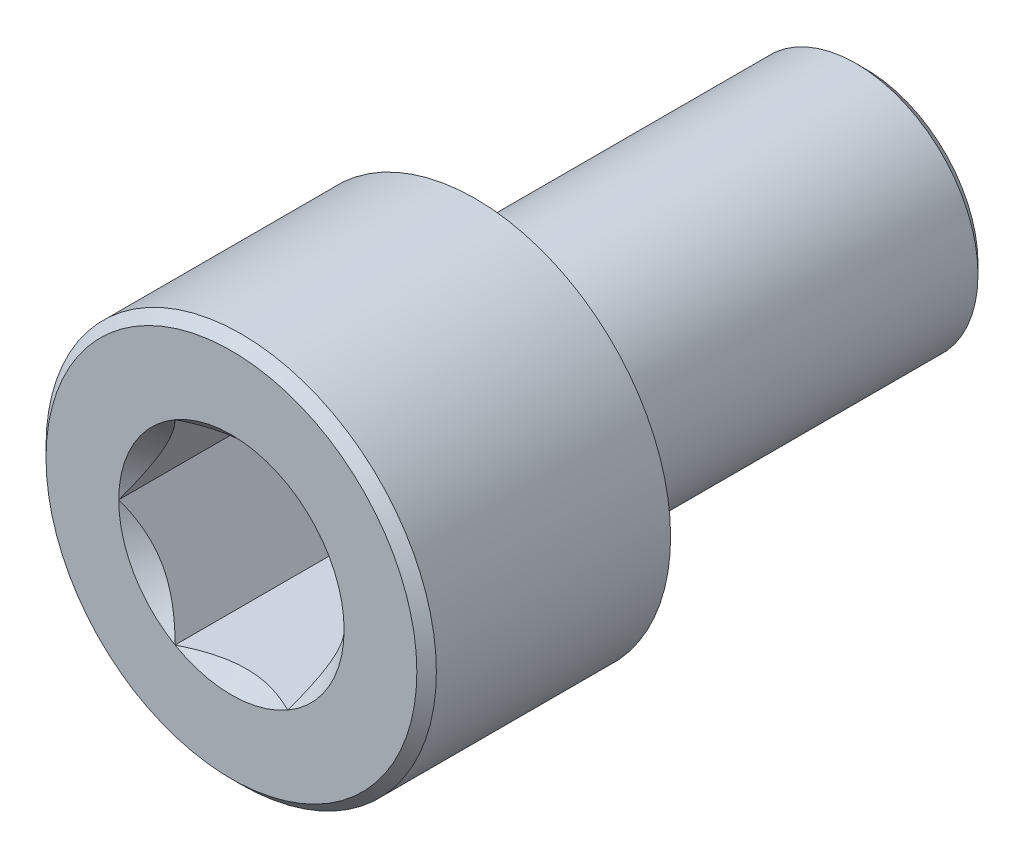
ISO-10303-21;
HEADER;
FILE_DESCRIPTION(('STEP AP214'),'2;1');
FILE_NAME('part.step','',(''),(''),'','','');
FILE_SCHEMA(('AUTOMOTIVE_DESIGN { 1 0 10303 214 1 1 1 1 }'));
ENDSEC;
DATA;
#1=APPLICATION_CONTEXT('core data for automotive mechanical design processes');
#2=APPLICATION_PROTOCOL_DEFINITION('international standard','automotive_design',2000,#1);
#3=PRODUCT_CONTEXT('',#1,'mechanical');
#4=PRODUCT('Part','Part','',(#3));
#5=PRODUCT_RELATED_PRODUCT_CATEGORY('part','',(#4));
#6=PRODUCT_DEFINITION_FORMATION('','',#4);
#7=PRODUCT_DEFINITION_CONTEXT('part definition',#1,'design');
#8=PRODUCT_DEFINITION('design','',#6,#7);
#9=PRODUCT_DEFINITION_SHAPE('','',#8);
#10=(LENGTH_UNIT() NAMED_UNIT(*) SI_UNIT(.MILLI.,.METRE.));
#11=(NAMED_UNIT(*) PLANE_ANGLE_UNIT() SI_UNIT($,.RADIAN.));
#12=(NAMED_UNIT(*) SI_UNIT($,.STERADIAN.) SOLID_ANGLE_UNIT());
#13=UNCERTAINTY_MEASURE_WITH_UNIT(LENGTH_MEASURE(1.E-05),#10,'distance_accuracy_value','');
#14=(GEOMETRIC_REPRESENTATION_CONTEXT(3) GLOBAL_UNCERTAINTY_ASSIGNED_CONTEXT((#13)) GLOBAL_UNIT_ASSIGNED_CONTEXT((#10,
#11,#12)) REPRESENTATION_CONTEXT('',''));
#15=CARTESIAN_POINT('',(0.,0.,0.));
#16=DIRECTION('',(0.,0.,1.));
#17=DIRECTION('',(1.,0.,0.));
#18=AXIS2_PLACEMENT_3D('',#15,#16,#17);
#19=CARTESIAN_POINT('',(0.,0.,0.));
#20=DIRECTION('',(0.,0.,1.));
#21=DIRECTION('',(1.,0.,0.));
#22=AXIS2_PLACEMENT_3D('',#19,#20,#21);
#23=PLANE('',#22);
#24=CARTESIAN_POINT('',(0.,0.,0.));
#25=DIRECTION('',(0.,0.,1.));
#26=DIRECTION('',(1.,0.,0.));
#27=AXIS2_PLACEMENT_3D('',#24,#25,#26);
#28=CIRCLE('',#27,4.);
#29=CARTESIAN_POINT('',(4.,0.,0.));
#30=VERTEX_POINT('',#29);
#31=EDGE_CURVE('E109',#30,#30,#28,.T.);
#32=ORIENTED_EDGE('',*,*,#31,.F.);
#33=EDGE_LOOP('',(#32));
#34=FACE_BOUND('',#33,.T.);
#35=CARTESIAN_POINT('',(0.,0.,0.));
#36=DIRECTION('',(0.,0.,1.));
#37=DIRECTION('',(1.,0.,0.));
#38=AXIS2_PLACEMENT_3D('',#35,#36,#37);
#39=CIRCLE('',#38,2.5);
#40=CARTESIAN_POINT('',(2.5,0.,0.));
#41=VERTEX_POINT('',#40);
#42=EDGE_CURVE('E173',#41,#41,#39,.F.);
#43=ORIENTED_EDGE('',*,*,#42,.F.);
#44=EDGE_LOOP('',(#43));
#45=FACE_BOUND('',#44,.T.);
#46=ADVANCED_FACE('F34',(#34,#45),#23,.F.);
#47=CARTESIAN_POINT('',(0.,0.,5.));
#48=DIRECTION('',(0.,0.,-1.));
#49=DIRECTION('',(-1.,0.,0.));
#50=AXIS2_PLACEMENT_3D('',#47,#48,#49);
#51=CYLINDRICAL_SURFACE('',#50,4.);
#52=CARTESIAN_POINT('',(0.,0.,4.8));
#53=DIRECTION('',(0.,0.,1.));
#54=DIRECTION('',(1.,0.,0.));
#55=AXIS2_PLACEMENT_3D('',#52,#53,#54);
#56=CIRCLE('',#55,4.);
#57=CARTESIAN_POINT('',(4.,0.,4.8));
#58=VERTEX_POINT('',#57);
#59=EDGE_CURVE('E170',#58,#58,#56,.F.);
#60=ORIENTED_EDGE('',*,*,#59,.T.);
#61=EDGE_LOOP('',(#60));
#62=FACE_BOUND('',#61,.T.);
#63=ORIENTED_EDGE('',*,*,#31,.T.);
#64=EDGE_LOOP('',(#63));
#65=FACE_BOUND('',#64,.T.);
#66=ADVANCED_FACE('F189',(#62,#65),#51,.T.);
#67=CARTESIAN_POINT('',(0.,0.,5.));
#68=DIRECTION('',(0.,0.,1.));
#69=DIRECTION('',(1.,0.,0.));
#70=AXIS2_PLACEMENT_3D('',#67,#68,#69);
#71=PLANE('',#70);
#72=CARTESIAN_POINT('',(0.,0.,5.));
#73=DIRECTION('',(0.,0.,1.));
#74=DIRECTION('',(1.,0.,0.));
#75=AXIS2_PLACEMENT_3D('',#72,#73,#74);
#76=CIRCLE('',#75,3.8);
#77=CARTESIAN_POINT('',(3.8,0.,5.));
#78=VERTEX_POINT('',#77);
#79=EDGE_CURVE('E108',#78,#78,#76,.T.);
#80=ORIENTED_EDGE('',*,*,#79,.T.);
#81=EDGE_LOOP('',(#80));
#82=FACE_BOUND('',#81,.T.);
#83=CARTESIAN_POINT('',(0.,0.,5.));
#84=DIRECTION('',(0.,0.,1.));
#85=DIRECTION('',(1.,0.,0.));
#86=AXIS2_PLACEMENT_3D('',#83,#84,#85);
#87=CIRCLE('',#86,2.30940107675851);
#88=CARTESIAN_POINT('',(2.30940107675851,0.,5.));
#89=VERTEX_POINT('',#88);
#90=CARTESIAN_POINT('',(1.15470053837925,2.,5.));
#91=VERTEX_POINT('',#90);
#92=EDGE_CURVE('E99',#89,#91,#87,.T.);
#93=ORIENTED_EDGE('',*,*,#92,.F.);
#94=CARTESIAN_POINT('',(1.15470053837925,-2.,5.));
#95=VERTEX_POINT('',#94);
#96=EDGE_CURVE('E88',#95,#89,#87,.T.);
#97=ORIENTED_EDGE('',*,*,#96,.F.);
#98=CARTESIAN_POINT('',(-1.15470053837925,-2.,5.));
#99=VERTEX_POINT('',#98);
#100=EDGE_CURVE('E97',#99,#95,#87,.T.);
#101=ORIENTED_EDGE('',*,*,#100,.F.);
#102=CARTESIAN_POINT('',(-2.30940107675851,0.,5.));
#103=VERTEX_POINT('',#102);
#104=EDGE_CURVE('E48',#103,#99,#87,.T.);
#105=ORIENTED_EDGE('',*,*,#104,.F.);
#106=CARTESIAN_POINT('',(-1.15470053837925,2.,5.));
#107=VERTEX_POINT('',#106);
#108=EDGE_CURVE('E55',#107,#103,#87,.T.);
#109=ORIENTED_EDGE('',*,*,#108,.F.);
#110=EDGE_CURVE('E130',#91,#107,#87,.T.);
#111=ORIENTED_EDGE('',*,*,#110,.F.);
#112=EDGE_LOOP('',(#93,#97,#101,#105,#109,#111));
#113=FACE_BOUND('',#112,.T.);
#114=ADVANCED_FACE('F129',(#82,#113),#71,.T.);
#115=CARTESIAN_POINT('',(0.,0.,5.));
#116=DIRECTION('',(0.,0.,1.));
#117=DIRECTION('',(1.,0.,0.));
#118=AXIS2_PLACEMENT_3D('',#115,#116,#117);
#119=CONICAL_SURFACE('',#118,2.30940107675851,0.78539816339745);
#120=ORIENTED_EDGE('',*,*,#92,.T.);
#121=CARTESIAN_POINT('',(2.30951654681234,-0.000199999999999566,5.00011547871366));
#122=CARTESIAN_POINT('',(2.26982196410711,0.0685530340307062,4.96045309022559));
#123=CARTESIAN_POINT('',(2.22946361676572,0.138455742135512,4.92311998228416));
#124=CARTESIAN_POINT('',(2.14716839667631,0.280995244550438,4.85476368513614));
#125=CARTESIAN_POINT('',(2.10522369580642,0.35364559756536,4.82377853373722));
#126=CARTESIAN_POINT('',(2.02064418875706,0.500141601053973,4.77070021654414));
#127=CARTESIAN_POINT('',(1.97803092714269,0.573949935246296,4.74847362717661));
#128=CARTESIAN_POINT('',(1.89186619344273,0.723191631835266,4.71422881667508));
#129=CARTESIAN_POINT('',(1.84831735425552,0.798620433918154,4.70218502914413));
#130=CARTESIAN_POINT('',(1.7732646674724,0.928615500671082,4.69131851190557));
#131=CARTESIAN_POINT('',(1.74185780396625,0.983013783970111,4.68970975360997));
#132=CARTESIAN_POINT('',(1.67909540053412,1.0917214555197,4.69241887759871));
#133=CARTESIAN_POINT('',(1.64773988246021,1.14603080592134,4.69673883775797));
#134=CARTESIAN_POINT('',(1.5853248994842,1.25413672758934,4.7110595674099));
#135=CARTESIAN_POINT('',(1.55426580541469,1.30793265655479,4.72106669276201));
#136=CARTESIAN_POINT('',(1.49268469862228,1.41459426230558,4.74621243024966));
#137=CARTESIAN_POINT('',(1.46216264491917,1.46746001007072,4.76135064904224));
#138=CARTESIAN_POINT('',(1.38397803138049,1.60287973308985,4.80629450342919));
#139=CARTESIAN_POINT('',(1.33680037273297,1.68459383484948,4.83948883942582));
#140=CARTESIAN_POINT('',(1.26742988897853,1.8047470372578,4.89552582317137));
#141=CARTESIAN_POINT('',(1.24456923461531,1.84434285210918,4.91521470294694));
#142=CARTESIAN_POINT('',(1.19927142554652,1.92280095888787,4.95638731836487));
#143=CARTESIAN_POINT('',(1.17683402097614,1.96166368359374,4.97786995165125));
#144=CARTESIAN_POINT('',(1.15458506832541,2.0002,5.00011547871366));
#145=B_SPLINE_CURVE_WITH_KNOTS('',3,(#121,#122,#123,#124,#125,#126,#127,#128,#129,#130,#131,
#132,#133,#134,#135,#136,#137,#138,#139,#140,#141,#142,#143,#144),.UNSPECIFIED.,.F.,.F.,(4,2,2,
2,2,2,2,2,2,2,2,4),(0.,0.266420613771064,0.53439375152339,0.798110374376916,1.06116288956937,
1.24939906803722,1.43770123566248,1.62621426093932,1.81471283831914,2.11415604834145,
2.26347170717791,2.41269626969771),.UNSPECIFIED.);
#146=EDGE_CURVE('E103',#89,#91,#145,.T.);
#147=ORIENTED_EDGE('',*,*,#146,.F.);
#148=EDGE_LOOP('',(#120,#147));
#149=FACE_BOUND('',#148,.T.);
#150=ADVANCED_FACE('F104',(#149),#119,.F.);
#151=ORIENTED_EDGE('',*,*,#110,.T.);
#152=CARTESIAN_POINT('',(-2.30294417292924,2.,5.74077135502772));
#153=CARTESIAN_POINT('',(-2.24687002663712,2.,5.69844327362597));
#154=CARTESIAN_POINT('',(-2.19048190536959,2.,5.65652515686434));
#155=CARTESIAN_POINT('',(-2.07695390496424,2.,5.57369041786102));
#156=CARTESIAN_POINT('',(-2.01981384066454,2.,5.53277404966807));
#157=CARTESIAN_POINT('',(-1.90424016804776,2.,5.45183345201856));
#158=CARTESIAN_POINT('',(-1.8457999674391,2.,5.41181859155987));
#159=CARTESIAN_POINT('',(-1.7279274546176,2.,5.33328899366429));
#160=CARTESIAN_POINT('',(-1.66849521292324,2.,5.29477415024314));
#161=CARTESIAN_POINT('',(-1.4816299571002,2.,5.17764065160429));
#162=CARTESIAN_POINT('',(-1.35220318163536,2.,5.10214590172964));
#163=CARTESIAN_POINT('',(-1.08689521592925,2.,4.96404935099438));
#164=CARTESIAN_POINT('',(-0.951037763938192,2.,4.9014040859035));
#165=CARTESIAN_POINT('',(-0.747111912259409,2.,4.82476354387514));
#166=CARTESIAN_POINT('',(-0.682064034147876,2.,4.80276717991912));
#167=CARTESIAN_POINT('',(-0.550398103294752,2.,4.76399668766014));
#168=CARTESIAN_POINT('',(-0.483779942722475,2.,4.74722291912118));
#169=CARTESIAN_POINT('',(-0.350484328847654,2.,4.72004825788444));
#170=CARTESIAN_POINT('',(-0.283829489364785,2.,4.70953817674169));
#171=CARTESIAN_POINT('',(-0.149806987139376,2.,4.69509608554492));
#172=CARTESIAN_POINT('',(-0.0824394489341215,2.,4.69116294473311));
#173=CARTESIAN_POINT('',(0.0499055622944903,2.,4.69016647693372));
#174=CARTESIAN_POINT('',(0.114881285143173,2.,4.69285964485041));
#175=CARTESIAN_POINT('',(0.244275921482761,2.,4.70443007042269));
#176=CARTESIAN_POINT('',(0.308694780266754,2.,4.71330792883322));
#177=CARTESIAN_POINT('',(0.437599788610706,2.,4.73691365929615));
#178=CARTESIAN_POINT('',(0.502067428644596,2.,4.75174108344651));
#179=CARTESIAN_POINT('',(0.629594322598307,2.,4.78645788362797));
#180=CARTESIAN_POINT('',(0.692653693883152,2.,4.80634683610628));
#181=CARTESIAN_POINT('',(0.891187889210545,2.,4.8764469792562));
#182=CARTESIAN_POINT('',(1.02383545707306,2.,4.93464180032151));
#183=CARTESIAN_POINT('',(1.28290932150074,2.,5.06403057545958));
#184=CARTESIAN_POINT('',(1.4093111258757,2.,5.13527123141484));
#185=CARTESIAN_POINT('',(1.59200441438963,2.,5.24644199187472));
#186=CARTESIAN_POINT('',(1.65027549026191,2.,5.28318219033737));
#187=CARTESIAN_POINT('',(1.76581760389243,2.,5.35821451418377));
#188=CARTESIAN_POINT('',(1.82308856543105,2.,5.39650675711804));
#189=CARTESIAN_POINT('',(1.93629654762084,2.,5.47404226408122));
#190=CARTESIAN_POINT('',(1.99224062500539,2.,5.51327527613358));
#191=CARTESIAN_POINT('',(2.103364240299,2.,5.59277883073651));
#192=CARTESIAN_POINT('',(2.15854398422468,2.,5.6330490850006));
#193=CARTESIAN_POINT('',(2.21340370692659,2.,5.67374423814594));
#194=B_SPLINE_CURVE_WITH_KNOTS('',3,(#152,#153,#154,#155,#156,#157,#158,#159,#160,#161,#162,
#163,#164,#165,#166,#167,#168,#169,#170,#171,#172,#173,#174,#175,#176,#177,#178,#179,#180,#181,
#182,#183,#184,#185,#186,#187,#188,#189,#190,#191,#192,#193),.UNSPECIFIED.,.F.,.F.,(4,2,2,2,2,2,
2,2,2,2,2,2,2,2,2,2,2,2,2,2,4),(0.,0.210772731976892,0.42159837465859,0.634057554623489,
0.846501695870171,1.29562155455624,1.74319622821645,1.94902062110208,2.15485918928326,
2.35699582502636,2.5590977043214,2.75388435553557,2.94868993014815,3.14690093452586,
3.34509535789702,3.77838155837654,4.21325029921625,4.41989056685647,4.62654651460921,
4.8315237711129,5.03644465914085),.UNSPECIFIED.);
#195=EDGE_CURVE('E131',#91,#107,#194,.F.);
#196=ORIENTED_EDGE('',*,*,#195,.F.);
#197=EDGE_LOOP('',(#151,#196));
#198=FACE_BOUND('',#197,.T.);
#199=ADVANCED_FACE('F216',(#198),#119,.F.);
#200=ORIENTED_EDGE('',*,*,#108,.T.);
#201=CARTESIAN_POINT('',(-1.15458506832541,2.0002,5.00011547871366));
#202=CARTESIAN_POINT('',(-1.19427965103065,1.9314469659693,4.96045309022559));
#203=CARTESIAN_POINT('',(-1.23463799837204,1.86154425786449,4.92311998228416));
#204=CARTESIAN_POINT('',(-1.31693321846145,1.71900475544957,4.85476368513614));
#205=CARTESIAN_POINT('',(-1.35887791933134,1.64635440243464,4.82377853373722));
#206=CARTESIAN_POINT('',(-1.44345742638069,1.49985839894603,4.77070021654414));
#207=CARTESIAN_POINT('',(-1.48607068799507,1.42605006475371,4.74847362717661));
#208=CARTESIAN_POINT('',(-1.57223542169503,1.27680836816474,4.71422881667508));
#209=CARTESIAN_POINT('',(-1.61578426088223,1.20137956608185,4.70218502914413));
#210=CARTESIAN_POINT('',(-1.69083694766536,1.07138449932892,4.69131851190557));
#211=CARTESIAN_POINT('',(-1.72224381117151,1.01698621602989,4.68970975360997));
#212=CARTESIAN_POINT('',(-1.78500621460364,0.908278544480307,4.69241887759871));
#213=CARTESIAN_POINT('',(-1.81636173267754,0.853969194078661,4.69673883775797));
#214=CARTESIAN_POINT('',(-1.87877671565355,0.745863272410662,4.7110595674099));
#215=CARTESIAN_POINT('',(-1.90983580972306,0.692067343445208,4.72106669276201));
#216=CARTESIAN_POINT('',(-1.97141691651548,0.585405737694426,4.74621243024966));
#217=CARTESIAN_POINT('',(-2.00193897021859,0.532539989929287,4.76135064904224));
#218=CARTESIAN_POINT('',(-2.08012358375727,0.397120266910156,4.80629450342919));
#219=CARTESIAN_POINT('',(-2.12730124240478,0.315406165150521,4.83948883942582));
#220=CARTESIAN_POINT('',(-2.19667172615923,0.195252962742197,4.89552582317137));
#221=CARTESIAN_POINT('',(-2.21953238052245,0.155657147890822,4.91521470294694));
#222=CARTESIAN_POINT('',(-2.26483018959124,0.0771990411121272,4.95638731836487));
#223=CARTESIAN_POINT('',(-2.28726759416161,0.0383363164062591,4.97786995165125));
#224=CARTESIAN_POINT('',(-2.30951654681234,-0.000200000000000581,5.00011547871366));
#225=B_SPLINE_CURVE_WITH_KNOTS('',3,(#201,#202,#203,#204,#205,#206,#207,#208,#209,#210,#211,
#212,#213,#214,#215,#216,#217,#218,#219,#220,#221,#222,#223,#224),.UNSPECIFIED.,.F.,.F.,(4,2,2,
2,2,2,2,2,2,2,2,4),(0.,0.266420613771064,0.534393751523389,0.798110374376915,1.06116288956937,
1.24939906803722,1.43770123566248,1.62621426093932,1.81471283831913,2.11415604834145,
2.26347170717791,2.41269626969771),.UNSPECIFIED.);
#226=EDGE_CURVE('E133',#107,#103,#225,.T.);
#227=ORIENTED_EDGE('',*,*,#226,.F.);
#228=EDGE_LOOP('',(#200,#227));
#229=FACE_BOUND('',#228,.T.);
#230=ADVANCED_FACE('F220',(#229),#119,.F.);
#231=ORIENTED_EDGE('',*,*,#104,.T.);
#232=CARTESIAN_POINT('',(-2.30951654681234,0.000199999999999566,5.00011547871366));
#233=CARTESIAN_POINT('',(-2.26982196410711,-0.0685530340307063,4.96045309022559));
#234=CARTESIAN_POINT('',(-2.22946361676572,-0.138455742135513,4.92311998228416));
#235=CARTESIAN_POINT('',(-2.14716839667631,-0.280995244550438,4.85476368513614));
#236=CARTESIAN_POINT('',(-2.10522369580642,-0.35364559756536,4.82377853373722));
#237=CARTESIAN_POINT('',(-2.02064418875706,-0.500141601053973,4.77070021654414));
#238=CARTESIAN_POINT('',(-1.97803092714269,-0.573949935246296,4.74847362717661));
#239=CARTESIAN_POINT('',(-1.89186619344273,-0.723191631835267,4.71422881667508));
#240=CARTESIAN_POINT('',(-1.84831735425552,-0.798620433918155,4.70218502914413));
#241=CARTESIAN_POINT('',(-1.7732646674724,-0.928615500671082,4.69131851190557));
#242=CARTESIAN_POINT('',(-1.74185780396625,-0.983013783970112,4.68970975360997));
#243=CARTESIAN_POINT('',(-1.67909540053412,-1.0917214555197,4.69241887759871));
#244=CARTESIAN_POINT('',(-1.64773988246021,-1.14603080592134,4.69673883775797));
#245=CARTESIAN_POINT('',(-1.5853248994842,-1.25413672758934,4.7110595674099));
#246=CARTESIAN_POINT('',(-1.55426580541469,-1.3079326565548,4.72106669276201));
#247=CARTESIAN_POINT('',(-1.49268469862228,-1.41459426230558,4.74621243024966));
#248=CARTESIAN_POINT('',(-1.46216264491917,-1.46746001007072,4.76135064904224));
#249=CARTESIAN_POINT('',(-1.38397803138049,-1.60287973308985,4.80629450342919));
#250=CARTESIAN_POINT('',(-1.33680037273297,-1.68459383484948,4.83948883942581));
#251=CARTESIAN_POINT('',(-1.26742988897853,-1.8047470372578,4.89552582317137));
#252=CARTESIAN_POINT('',(-1.24456923461531,-1.84434285210918,4.91521470294694));
#253=CARTESIAN_POINT('',(-1.19927142554652,-1.92280095888787,4.95638731836487));
#254=CARTESIAN_POINT('',(-1.17683402097614,-1.96166368359374,4.97786995165125));
#255=CARTESIAN_POINT('',(-1.15458506832541,-2.0002,5.00011547871366));
#256=B_SPLINE_CURVE_WITH_KNOTS('',3,(#232,#233,#234,#235,#236,#237,#238,#239,#240,#241,#242,
#243,#244,#245,#246,#247,#248,#249,#250,#251,#252,#253,#254,#255),.UNSPECIFIED.,.F.,.F.,(4,2,2,
2,2,2,2,2,2,2,2,4),(0.,0.266420613771064,0.53439375152339,0.798110374376917,1.06116288956937,
1.24939906803722,1.43770123566248,1.62621426093932,1.81471283831914,2.11415604834145,
2.26347170717791,2.41269626969771),.UNSPECIFIED.);
#257=EDGE_CURVE('E237',#103,#99,#256,.T.);
#258=ORIENTED_EDGE('',*,*,#257,.F.);
#259=EDGE_LOOP('',(#231,#258));
#260=FACE_BOUND('',#259,.T.);
#261=ADVANCED_FACE('F229',(#260),#119,.F.);
#262=ORIENTED_EDGE('',*,*,#100,.T.);
#263=CARTESIAN_POINT('',(-2.30294417292923,-2.,5.74077135502772));
#264=CARTESIAN_POINT('',(-2.24687002663712,-2.,5.69844327362596));
#265=CARTESIAN_POINT('',(-2.19048190536959,-2.,5.65652515686434));
#266=CARTESIAN_POINT('',(-2.07695390496424,-2.,5.57369041786102));
#267=CARTESIAN_POINT('',(-2.01981384066454,-2.,5.53277404966807));
#268=CARTESIAN_POINT('',(-1.90424016804776,-2.,5.45183345201856));
#269=CARTESIAN_POINT('',(-1.8457999674391,-2.,5.41181859155987));
#270=CARTESIAN_POINT('',(-1.7279274546176,-2.,5.33328899366429));
#271=CARTESIAN_POINT('',(-1.66849521292324,-2.,5.29477415024314));
#272=CARTESIAN_POINT('',(-1.4816299571002,-2.,5.1776406516043));
#273=CARTESIAN_POINT('',(-1.35220318163536,-2.,5.10214590172964));
#274=CARTESIAN_POINT('',(-1.08689521592925,-2.,4.96404935099438));
#275=CARTESIAN_POINT('',(-0.951037763938193,-2.,4.9014040859035));
#276=CARTESIAN_POINT('',(-0.747111912259409,-2.,4.82476354387514));
#277=CARTESIAN_POINT('',(-0.682064034147876,-2.,4.80276717991912));
#278=CARTESIAN_POINT('',(-0.550398103294752,-2.,4.76399668766014));
#279=CARTESIAN_POINT('',(-0.483779942722476,-2.,4.74722291912118));
#280=CARTESIAN_POINT('',(-0.350484328847654,-2.,4.72004825788444));
#281=CARTESIAN_POINT('',(-0.283829489364785,-2.,4.70953817674169));
#282=CARTESIAN_POINT('',(-0.149806987139377,-2.,4.69509608554491));
#283=CARTESIAN_POINT('',(-0.082439448934122,-2.,4.69116294473311));
#284=CARTESIAN_POINT('',(0.0499055622944898,-2.,4.69016647693372));
#285=CARTESIAN_POINT('',(0.114881285143172,-2.,4.69285964485041));
#286=CARTESIAN_POINT('',(0.244275921482761,-2.,4.70443007042269));
#287=CARTESIAN_POINT('',(0.308694780266754,-2.,4.71330792883322));
#288=CARTESIAN_POINT('',(0.437599788610705,-2.,4.73691365929615));
#289=CARTESIAN_POINT('',(0.502067428644596,-2.,4.75174108344651));
#290=CARTESIAN_POINT('',(0.629594322598307,-2.,4.78645788362797));
#291=CARTESIAN_POINT('',(0.692653693883151,-2.,4.80634683610628));
#292=CARTESIAN_POINT('',(0.891187889210545,-2.,4.8764469792562));
#293=CARTESIAN_POINT('',(1.02383545707306,-2.,4.93464180032151));
#294=CARTESIAN_POINT('',(1.28290932150074,-2.,5.06403057545958));
#295=CARTESIAN_POINT('',(1.4093111258757,-2.,5.13527123141484));
#296=CARTESIAN_POINT('',(1.59200441438963,-2.,5.24644199187472));
#297=CARTESIAN_POINT('',(1.65027549026191,-2.,5.28318219033737));
#298=CARTESIAN_POINT('',(1.76581760389243,-2.,5.35821451418377));
#299=CARTESIAN_POINT('',(1.82308856543105,-2.,5.39650675711804));
#300=CARTESIAN_POINT('',(1.93629654762084,-2.,5.47404226408123));
#301=CARTESIAN_POINT('',(1.99224062500539,-2.,5.51327527613358));
#302=CARTESIAN_POINT('',(2.103364240299,-2.,5.59277883073652));
#303=CARTESIAN_POINT('',(2.15854398422468,-2.,5.6330490850006));
#304=CARTESIAN_POINT('',(2.21340370692659,-2.,5.67374423814594));
#305=B_SPLINE_CURVE_WITH_KNOTS('',3,(#263,#264,#265,#266,#267,#268,#269,#270,#271,#272,#273,
#274,#275,#276,#277,#278,#279,#280,#281,#282,#283,#284,#285,#286,#287,#288,#289,#290,#291,#292,
#293,#294,#295,#296,#297,#298,#299,#300,#301,#302,#303,#304),.UNSPECIFIED.,.F.,.F.,(4,2,2,2,2,2,
2,2,2,2,2,2,2,2,2,2,2,2,2,2,4),(0.,0.210772731976892,0.421598374658589,0.634057554623488,
0.84650169587017,1.29562155455624,1.74319622821645,1.94902062110207,2.15485918928326,
2.35699582502635,2.5590977043214,2.75388435553556,2.94868993014815,3.14690093452586,
3.34509535789702,3.77838155837654,4.21325029921625,4.41989056685647,4.62654651460921,
4.8315237711129,5.03644465914085),.UNSPECIFIED.);
#306=EDGE_CURVE('E119',#99,#95,#305,.T.);
#307=ORIENTED_EDGE('',*,*,#306,.F.);
#308=EDGE_LOOP('',(#262,#307));
#309=FACE_BOUND('',#308,.T.);
#310=ADVANCED_FACE('F223',(#309),#119,.F.);
#311=ORIENTED_EDGE('',*,*,#96,.T.);
#312=CARTESIAN_POINT('',(1.15458506832542,-2.0002,5.00011547871366));
#313=CARTESIAN_POINT('',(1.19427965103065,-1.9314469659693,4.96045309022559));
#314=CARTESIAN_POINT('',(1.23463799837204,-1.86154425786449,4.92311998228416));
#315=CARTESIAN_POINT('',(1.31693321846145,-1.71900475544957,4.85476368513614));
#316=CARTESIAN_POINT('',(1.35887791933134,-1.64635440243464,4.82377853373722));
#317=CARTESIAN_POINT('',(1.44345742638069,-1.49985839894603,4.77070021654414));
#318=CARTESIAN_POINT('',(1.48607068799507,-1.42605006475371,4.74847362717661));
#319=CARTESIAN_POINT('',(1.57223542169503,-1.27680836816474,4.71422881667508));
#320=CARTESIAN_POINT('',(1.61578426088223,-1.20137956608185,4.70218502914413));
#321=CARTESIAN_POINT('',(1.69083694766536,-1.07138449932892,4.69131851190557));
#322=CARTESIAN_POINT('',(1.72224381117151,-1.01698621602989,4.68970975360997));
#323=CARTESIAN_POINT('',(1.78500621460364,-0.908278544480307,4.69241887759871));
#324=CARTESIAN_POINT('',(1.81636173267754,-0.853969194078662,4.69673883775797));
#325=CARTESIAN_POINT('',(1.87877671565355,-0.745863272410663,4.7110595674099));
#326=CARTESIAN_POINT('',(1.90983580972306,-0.692067343445208,4.72106669276201));
#327=CARTESIAN_POINT('',(1.97141691651548,-0.585405737694427,4.74621243024966));
#328=CARTESIAN_POINT('',(2.00193897021859,-0.532539989929288,4.76135064904224));
#329=CARTESIAN_POINT('',(2.08012358375727,-0.397120266910156,4.80629450342919));
#330=CARTESIAN_POINT('',(2.12730124240478,-0.315406165150521,4.83948883942581));
#331=CARTESIAN_POINT('',(2.19667172615923,-0.195252962742197,4.89552582317137));
#332=CARTESIAN_POINT('',(2.21953238052245,-0.155657147890822,4.91521470294694));
#333=CARTESIAN_POINT('',(2.26483018959124,-0.0771990411121273,4.95638731836487));
#334=CARTESIAN_POINT('',(2.28726759416161,-0.0383363164062593,4.97786995165125));
#335=CARTESIAN_POINT('',(2.30951654681234,0.000200000000000398,5.00011547871366));
#336=B_SPLINE_CURVE_WITH_KNOTS('',3,(#312,#313,#314,#315,#316,#317,#318,#319,#320,#321,#322,
#323,#324,#325,#326,#327,#328,#329,#330,#331,#332,#333,#334,#335),.UNSPECIFIED.,.F.,.F.,(4,2,2,
2,2,2,2,2,2,2,2,4),(0.,0.266420613771064,0.534393751523389,0.798110374376915,1.06116288956936,
1.24939906803722,1.43770123566248,1.62621426093932,1.81471283831913,2.11415604834145,
2.26347170717791,2.41269626969771),.UNSPECIFIED.);
#337=EDGE_CURVE('E92',#95,#89,#336,.T.);
#338=ORIENTED_EDGE('',*,*,#337,.F.);
#339=EDGE_LOOP('',(#311,#338));
#340=FACE_BOUND('',#339,.T.);
#341=ADVANCED_FACE('F90',(#340),#119,.F.);
#342=CARTESIAN_POINT('',(0.,0.,1.6));
#343=DIRECTION('',(0.,0.,1.));
#344=DIRECTION('',(1.,0.,0.));
#345=AXIS2_PLACEMENT_3D('',#342,#343,#344);
#346=PLANE('',#345);
#347=DIRECTION('',(0.5,0.866025403784439,0.));
#348=VECTOR('',#347,1.);
#349=CARTESIAN_POINT('',(1.15470053837925,-2.,1.6));
#350=LINE('',#349,#348);
#351=CARTESIAN_POINT('',(1.15470053837925,-2.,1.6));
#352=VERTEX_POINT('',#351);
#353=CARTESIAN_POINT('',(2.3094010767585,0.,1.6));
#354=VERTEX_POINT('',#353);
#355=EDGE_CURVE('E118',#352,#354,#350,.T.);
#356=ORIENTED_EDGE('',*,*,#355,.T.);
#357=DIRECTION('',(-0.5,0.866025403784439,0.));
#358=VECTOR('',#357,1.);
#359=CARTESIAN_POINT('',(2.3094010767585,0.,1.6));
#360=LINE('',#359,#358);
#361=CARTESIAN_POINT('',(1.15470053837925,2.,1.6));
#362=VERTEX_POINT('',#361);
#363=EDGE_CURVE('E123',#354,#362,#360,.T.);
#364=ORIENTED_EDGE('',*,*,#363,.T.);
#365=DIRECTION('',(-1.,0.,0.));
#366=VECTOR('',#365,1.);
#367=CARTESIAN_POINT('',(1.15470053837925,2.,1.6));
#368=LINE('',#367,#366);
#369=CARTESIAN_POINT('',(-1.15470053837925,2.,1.6));
#370=VERTEX_POINT('',#369);
#371=EDGE_CURVE('E259',#362,#370,#368,.T.);
#372=ORIENTED_EDGE('',*,*,#371,.T.);
#373=DIRECTION('',(-0.5,-0.866025403784439,0.));
#374=VECTOR('',#373,1.);
#375=CARTESIAN_POINT('',(-1.15470053837925,2.,1.6));
#376=LINE('',#375,#374);
#377=CARTESIAN_POINT('',(-2.3094010767585,0.,1.6));
#378=VERTEX_POINT('',#377);
#379=EDGE_CURVE('E262',#370,#378,#376,.T.);
#380=ORIENTED_EDGE('',*,*,#379,.T.);
#381=DIRECTION('',(0.5,-0.866025403784438,0.));
#382=VECTOR('',#381,1.);
#383=CARTESIAN_POINT('',(-2.3094010767585,0.,1.6));
#384=LINE('',#383,#382);
#385=CARTESIAN_POINT('',(-1.15470053837925,-2.,1.6));
#386=VERTEX_POINT('',#385);
#387=EDGE_CURVE('E268',#378,#386,#384,.T.);
#388=ORIENTED_EDGE('',*,*,#387,.T.);
#389=DIRECTION('',(1.,0.,0.));
#390=VECTOR('',#389,1.);
#391=CARTESIAN_POINT('',(-1.15470053837925,-2.,1.6));
#392=LINE('',#391,#390);
#393=EDGE_CURVE('E126',#386,#352,#392,.T.);
#394=ORIENTED_EDGE('',*,*,#393,.T.);
#395=EDGE_LOOP('',(#356,#364,#372,#380,#388,#394));
#396=FACE_BOUND('',#395,.T.);
#397=ADVANCED_FACE('F160',(#396),#346,.T.);
#398=CARTESIAN_POINT('',(2.3094010767585,0.,1.6));
#399=DIRECTION('',(0.866025403784439,0.5,0.));
#400=DIRECTION('',(-0.5,0.866025403784439,0.));
#401=AXIS2_PLACEMENT_3D('',#398,#399,#400);
#402=PLANE('',#401);
#403=DIRECTION('',(0.,0.,1.));
#404=VECTOR('',#403,1.);
#405=CARTESIAN_POINT('',(2.3094010767585,0.,1.6));
#406=LINE('',#405,#404);
#407=EDGE_CURVE('E114',#354,#89,#406,.T.);
#408=ORIENTED_EDGE('',*,*,#407,.T.);
#409=ORIENTED_EDGE('',*,*,#146,.T.);
#410=DIRECTION('',(0.,0.,1.));
#411=VECTOR('',#410,1.);
#412=CARTESIAN_POINT('',(1.15470053837925,2.,1.6));
#413=LINE('',#412,#411);
#414=EDGE_CURVE('E125',#362,#91,#413,.T.);
#415=ORIENTED_EDGE('',*,*,#414,.F.);
#416=ORIENTED_EDGE('',*,*,#363,.F.);
#417=EDGE_LOOP('',(#408,#409,#415,#416));
#418=FACE_BOUND('',#417,.T.);
#419=ADVANCED_FACE('F121',(#418),#402,.F.);
#420=CARTESIAN_POINT('',(1.15470053837925,2.,1.6));
#421=DIRECTION('',(0.,1.,0.));
#422=DIRECTION('',(-1.,0.,0.));
#423=AXIS2_PLACEMENT_3D('',#420,#421,#422);
#424=PLANE('',#423);
#425=ORIENTED_EDGE('',*,*,#414,.T.);
#426=ORIENTED_EDGE('',*,*,#195,.T.);
#427=DIRECTION('',(0.,0.,1.));
#428=VECTOR('',#427,1.);
#429=CARTESIAN_POINT('',(-1.15470053837925,2.,1.6));
#430=LINE('',#429,#428);
#431=EDGE_CURVE('E251',#370,#107,#430,.T.);
#432=ORIENTED_EDGE('',*,*,#431,.F.);
#433=ORIENTED_EDGE('',*,*,#371,.F.);
#434=EDGE_LOOP('',(#425,#426,#432,#433));
#435=FACE_BOUND('',#434,.T.);
#436=ADVANCED_FACE('F149',(#435),#424,.F.);
#437=CARTESIAN_POINT('',(-1.15470053837925,2.,1.6));
#438=DIRECTION('',(-0.866025403784439,0.5,0.));
#439=DIRECTION('',(-0.5,-0.866025403784439,0.));
#440=AXIS2_PLACEMENT_3D('',#437,#438,#439);
#441=PLANE('',#440);
#442=ORIENTED_EDGE('',*,*,#431,.T.);
#443=ORIENTED_EDGE('',*,*,#226,.T.);
#444=DIRECTION('',(0.,0.,1.));
#445=VECTOR('',#444,1.);
#446=CARTESIAN_POINT('',(-2.3094010767585,0.,1.6));
#447=LINE('',#446,#445);
#448=EDGE_CURVE('E245',#378,#103,#447,.T.);
#449=ORIENTED_EDGE('',*,*,#448,.F.);
#450=ORIENTED_EDGE('',*,*,#379,.F.);
#451=EDGE_LOOP('',(#442,#443,#449,#450));
#452=FACE_BOUND('',#451,.T.);
#453=ADVANCED_FACE('F153',(#452),#441,.F.);
#454=CARTESIAN_POINT('',(-2.3094010767585,0.,1.6));
#455=DIRECTION('',(-0.866025403784438,-0.5,0.));
#456=DIRECTION('',(0.5,-0.866025403784439,0.));
#457=AXIS2_PLACEMENT_3D('',#454,#455,#456);
#458=PLANE('',#457);
#459=ORIENTED_EDGE('',*,*,#448,.T.);
#460=ORIENTED_EDGE('',*,*,#257,.T.);
#461=DIRECTION('',(0.,0.,1.));
#462=VECTOR('',#461,1.);
#463=CARTESIAN_POINT('',(-1.15470053837925,-2.,1.6));
#464=LINE('',#463,#462);
#465=EDGE_CURVE('E243',#386,#99,#464,.T.);
#466=ORIENTED_EDGE('',*,*,#465,.F.);
#467=ORIENTED_EDGE('',*,*,#387,.F.);
#468=EDGE_LOOP('',(#459,#460,#466,#467));
#469=FACE_BOUND('',#468,.T.);
#470=ADVANCED_FACE('F241',(#469),#458,.F.);
#471=CARTESIAN_POINT('',(-1.15470053837925,-2.,1.6));
#472=DIRECTION('',(0.,-1.,0.));
#473=DIRECTION('',(0.,0.,-1.));
#474=AXIS2_PLACEMENT_3D('',#471,#472,#473);
#475=PLANE('',#474);
#476=ORIENTED_EDGE('',*,*,#465,.T.);
#477=ORIENTED_EDGE('',*,*,#306,.T.);
#478=DIRECTION('',(0.,0.,1.));
#479=VECTOR('',#478,1.);
#480=CARTESIAN_POINT('',(1.15470053837925,-2.,1.6));
#481=LINE('',#480,#479);
#482=EDGE_CURVE('E116',#352,#95,#481,.T.);
#483=ORIENTED_EDGE('',*,*,#482,.F.);
#484=ORIENTED_EDGE('',*,*,#393,.F.);
#485=EDGE_LOOP('',(#476,#477,#483,#484));
#486=FACE_BOUND('',#485,.T.);
#487=ADVANCED_FACE('F207',(#486),#475,.F.);
#488=CARTESIAN_POINT('',(1.15470053837925,-2.,1.6));
#489=DIRECTION('',(0.866025403784439,-0.5,0.));
#490=DIRECTION('',(0.5,0.866025403784439,0.));
#491=AXIS2_PLACEMENT_3D('',#488,#489,#490);
#492=PLANE('',#491);
#493=ORIENTED_EDGE('',*,*,#482,.T.);
#494=ORIENTED_EDGE('',*,*,#337,.T.);
#495=ORIENTED_EDGE('',*,*,#407,.F.);
#496=ORIENTED_EDGE('',*,*,#355,.F.);
#497=EDGE_LOOP('',(#493,#494,#495,#496));
#498=FACE_BOUND('',#497,.T.);
#499=ADVANCED_FACE('F112',(#498),#492,.F.);
#500=CARTESIAN_POINT('',(0.,0.,5.));
#501=DIRECTION('',(0.,0.,-1.));
#502=DIRECTION('',(-1.,0.,0.));
#503=AXIS2_PLACEMENT_3D('',#500,#501,#502);
#504=CONICAL_SURFACE('',#503,3.8,0.785398163397448);
#505=ORIENTED_EDGE('',*,*,#59,.F.);
#506=EDGE_LOOP('',(#505));
#507=FACE_BOUND('',#506,.T.);
#508=ORIENTED_EDGE('',*,*,#79,.F.);
#509=EDGE_LOOP('',(#508));
#510=FACE_BOUND('',#509,.T.);
#511=ADVANCED_FACE('F199',(#507,#510),#504,.T.);
#512=CARTESIAN_POINT('',(0.,0.,-8.));
#513=DIRECTION('',(0.,0.,1.));
#514=DIRECTION('',(1.,0.,0.));
#515=AXIS2_PLACEMENT_3D('',#512,#513,#514);
#516=CYLINDRICAL_SURFACE('',#515,2.5);
#517=CARTESIAN_POINT('',(0.,0.,-7.8));
#518=DIRECTION('',(0.,0.,-1.));
#519=DIRECTION('',(-1.,0.,0.));
#520=AXIS2_PLACEMENT_3D('',#517,#518,#519);
#521=CIRCLE('',#520,2.5);
#522=CARTESIAN_POINT('',(-2.5,0.,-7.8));
#523=VERTEX_POINT('',#522);
#524=EDGE_CURVE('E11',#523,#523,#521,.F.);
#525=ORIENTED_EDGE('',*,*,#524,.T.);
#526=EDGE_LOOP('',(#525));
#527=FACE_BOUND('',#526,.T.);
#528=ORIENTED_EDGE('',*,*,#42,.T.);
#529=EDGE_LOOP('',(#528));
#530=FACE_BOUND('',#529,.T.);
#531=ADVANCED_FACE('F185',(#527,#530),#516,.T.);
#532=CARTESIAN_POINT('',(0.,0.,-8.));
#533=DIRECTION('',(0.,0.,-1.));
#534=DIRECTION('',(-1.,0.,0.));
#535=AXIS2_PLACEMENT_3D('',#532,#533,#534);
#536=PLANE('',#535);
#537=CARTESIAN_POINT('',(0.,0.,-8.));
#538=DIRECTION('',(0.,0.,-1.));
#539=DIRECTION('',(-1.,0.,0.));
#540=AXIS2_PLACEMENT_3D('',#537,#538,#539);
#541=CIRCLE('',#540,2.3);
#542=CARTESIAN_POINT('',(-2.3,0.,-8.));
#543=VERTEX_POINT('',#542);
#544=EDGE_CURVE('E42',#543,#543,#541,.T.);
#545=ORIENTED_EDGE('',*,*,#544,.T.);
#546=EDGE_LOOP('',(#545));
#547=FACE_BOUND('',#546,.T.);
#548=ADVANCED_FACE('F178',(#547),#536,.T.);
#549=CARTESIAN_POINT('',(0.,0.,-8.));
#550=DIRECTION('',(0.,0.,1.));
#551=DIRECTION('',(1.,0.,0.));
#552=AXIS2_PLACEMENT_3D('',#549,#550,#551);
#553=CONICAL_SURFACE('',#552,2.3,0.785398163397454);
#554=ORIENTED_EDGE('',*,*,#524,.F.);
#555=EDGE_LOOP('',(#554));
#556=FACE_BOUND('',#555,.T.);
#557=ORIENTED_EDGE('',*,*,#544,.F.);
#558=EDGE_LOOP('',(#557));
#559=FACE_BOUND('',#558,.T.);
#560=ADVANCED_FACE('F36',(#556,#559),#553,.T.);
#561=CLOSED_SHELL('',(#46,#66,#114,#150,#199,#230,#261,#310,#341,#397,#419,#436,#453,#470,#487,
#499,#511,#531,#548,#560));
#562=MANIFOLD_SOLID_BREP('B2',#561);
#563=ADVANCED_BREP_SHAPE_REPRESENTATION('',(#18,#562),#14);
#564=SHAPE_DEFINITION_REPRESENTATION(#9,#563);
ENDSEC;
END-ISO-10303-21;
